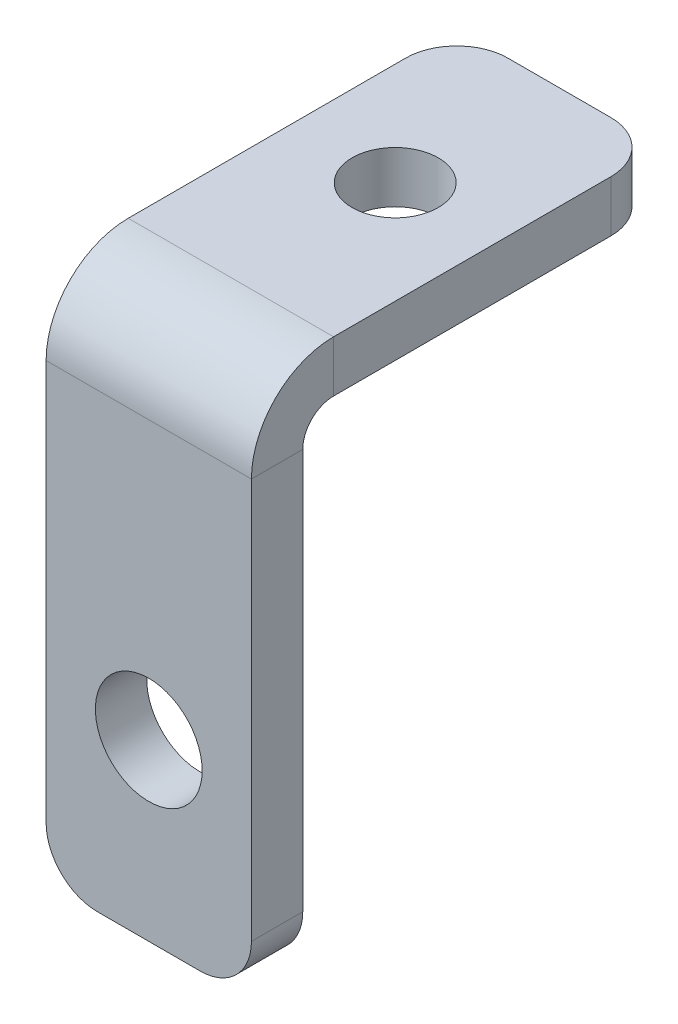
ISO-10303-21;
HEADER;
FILE_DESCRIPTION(('STEP AP214'),'2;1');
FILE_NAME('part.step','',(''),(''),'','','');
FILE_SCHEMA(('AUTOMOTIVE_DESIGN { 1 0 10303 214 1 1 1 1 }'));
ENDSEC;
DATA;
#1=APPLICATION_CONTEXT('core data for automotive mechanical design processes');
#2=APPLICATION_PROTOCOL_DEFINITION('international standard','automotive_design',2000,#1);
#3=PRODUCT_CONTEXT('',#1,'mechanical');
#4=PRODUCT('Part','Part','',(#3));
#5=PRODUCT_RELATED_PRODUCT_CATEGORY('part','',(#4));
#6=PRODUCT_DEFINITION_FORMATION('','',#4);
#7=PRODUCT_DEFINITION_CONTEXT('part definition',#1,'design');
#8=PRODUCT_DEFINITION('design','',#6,#7);
#9=PRODUCT_DEFINITION_SHAPE('','',#8);
#10=(LENGTH_UNIT() NAMED_UNIT(*) SI_UNIT(.MILLI.,.METRE.));
#11=(NAMED_UNIT(*) PLANE_ANGLE_UNIT() SI_UNIT($,.RADIAN.));
#12=(NAMED_UNIT(*) SI_UNIT($,.STERADIAN.) SOLID_ANGLE_UNIT());
#13=UNCERTAINTY_MEASURE_WITH_UNIT(LENGTH_MEASURE(1.E-05),#10,'distance_accuracy_value','');
#14=(GEOMETRIC_REPRESENTATION_CONTEXT(3) GLOBAL_UNCERTAINTY_ASSIGNED_CONTEXT((#13)) GLOBAL_UNIT_ASSIGNED_CONTEXT((#10,
#11,#12)) REPRESENTATION_CONTEXT('',''));
#15=CARTESIAN_POINT('',(0.,0.,0.));
#16=DIRECTION('',(0.,0.,1.));
#17=DIRECTION('',(1.,0.,0.));
#18=AXIS2_PLACEMENT_3D('',#15,#16,#17);
#19=CARTESIAN_POINT('',(5.,-11.,-2.5));
#20=DIRECTION('',(1.,0.,0.));
#21=DIRECTION('',(0.,0.,-1.));
#22=AXIS2_PLACEMENT_3D('',#19,#20,#21);
#23=PLANE('',#22);
#24=DIRECTION('',(0.,1.,0.));
#25=VECTOR('',#24,1.);
#26=CARTESIAN_POINT('',(5.,-11.,0.));
#27=LINE('',#26,#25);
#28=CARTESIAN_POINT('',(5.,-8.5,0.));
#29=VERTEX_POINT('',#28);
#30=CARTESIAN_POINT('',(5.,11.,0.));
#31=VERTEX_POINT('',#30);
#32=EDGE_CURVE('E164',#29,#31,#27,.T.);
#33=ORIENTED_EDGE('',*,*,#32,.F.);
#34=DIRECTION('',(0.,0.,1.));
#35=VECTOR('',#34,1.);
#36=CARTESIAN_POINT('',(5.,-8.5,-2.5));
#37=LINE('',#36,#35);
#38=CARTESIAN_POINT('',(5.,-8.5,-2.5));
#39=VERTEX_POINT('',#38);
#40=EDGE_CURVE('E210',#29,#39,#37,.F.);
#41=ORIENTED_EDGE('',*,*,#40,.T.);
#42=DIRECTION('',(0.,1.,0.));
#43=VECTOR('',#42,1.);
#44=CARTESIAN_POINT('',(5.,-11.,-2.5));
#45=LINE('',#44,#43);
#46=CARTESIAN_POINT('',(5.,11.,-2.5));
#47=VERTEX_POINT('',#46);
#48=EDGE_CURVE('E170',#39,#47,#45,.T.);
#49=ORIENTED_EDGE('',*,*,#48,.T.);
#50=DIRECTION('',(0.,0.,1.));
#51=VECTOR('',#50,1.);
#52=CARTESIAN_POINT('',(5.,11.,-2.5));
#53=LINE('',#52,#51);
#54=EDGE_CURVE('E184',#47,#31,#53,.T.);
#55=ORIENTED_EDGE('',*,*,#54,.T.);
#56=EDGE_LOOP('',(#33,#41,#49,#55));
#57=FACE_BOUND('',#56,.T.);
#58=ADVANCED_FACE('F16',(#57),#23,.T.);
#59=CARTESIAN_POINT('',(-5.,-11.,-2.5));
#60=DIRECTION('',(0.,-1.,0.));
#61=DIRECTION('',(0.,0.,-1.));
#62=AXIS2_PLACEMENT_3D('',#59,#60,#61);
#63=PLANE('',#62);
#64=DIRECTION('',(1.,0.,0.));
#65=VECTOR('',#64,1.);
#66=CARTESIAN_POINT('',(-5.,-11.,-2.5));
#67=LINE('',#66,#65);
#68=CARTESIAN_POINT('',(-2.5,-11.,-2.5));
#69=VERTEX_POINT('',#68);
#70=CARTESIAN_POINT('',(2.5,-11.,-2.5));
#71=VERTEX_POINT('',#70);
#72=EDGE_CURVE('E180',#69,#71,#67,.T.);
#73=ORIENTED_EDGE('',*,*,#72,.T.);
#74=DIRECTION('',(0.,0.,1.));
#75=VECTOR('',#74,1.);
#76=CARTESIAN_POINT('',(2.5,-11.,-2.5));
#77=LINE('',#76,#75);
#78=CARTESIAN_POINT('',(2.5,-11.,0.));
#79=VERTEX_POINT('',#78);
#80=EDGE_CURVE('E203',#71,#79,#77,.T.);
#81=ORIENTED_EDGE('',*,*,#80,.T.);
#82=DIRECTION('',(1.,0.,0.));
#83=VECTOR('',#82,1.);
#84=CARTESIAN_POINT('',(-5.,-11.,0.));
#85=LINE('',#84,#83);
#86=CARTESIAN_POINT('',(-2.5,-11.,0.));
#87=VERTEX_POINT('',#86);
#88=EDGE_CURVE('E174',#87,#79,#85,.T.);
#89=ORIENTED_EDGE('',*,*,#88,.F.);
#90=DIRECTION('',(0.,0.,1.));
#91=VECTOR('',#90,1.);
#92=CARTESIAN_POINT('',(-2.5,-11.,-2.5));
#93=LINE('',#92,#91);
#94=EDGE_CURVE('E199',#87,#69,#93,.F.);
#95=ORIENTED_EDGE('',*,*,#94,.T.);
#96=EDGE_LOOP('',(#73,#81,#89,#95));
#97=FACE_BOUND('',#96,.T.);
#98=ADVANCED_FACE('F277',(#97),#63,.T.);
#99=CARTESIAN_POINT('',(-5.,-11.,-2.5));
#100=DIRECTION('',(-1.,0.,0.));
#101=DIRECTION('',(0.,0.,1.));
#102=AXIS2_PLACEMENT_3D('',#99,#100,#101);
#103=PLANE('',#102);
#104=DIRECTION('',(0.,-1.,0.));
#105=VECTOR('',#104,1.);
#106=CARTESIAN_POINT('',(-5.,-11.,-2.5));
#107=LINE('',#106,#105);
#108=CARTESIAN_POINT('',(-5.,11.,-2.5));
#109=VERTEX_POINT('',#108);
#110=CARTESIAN_POINT('',(-5.,-8.5,-2.5));
#111=VERTEX_POINT('',#110);
#112=EDGE_CURVE('E177',#109,#111,#107,.T.);
#113=ORIENTED_EDGE('',*,*,#112,.T.);
#114=DIRECTION('',(0.,0.,1.));
#115=VECTOR('',#114,1.);
#116=CARTESIAN_POINT('',(-5.,-8.5,-2.5));
#117=LINE('',#116,#115);
#118=CARTESIAN_POINT('',(-5.,-8.5,0.));
#119=VERTEX_POINT('',#118);
#120=EDGE_CURVE('E216',#111,#119,#117,.T.);
#121=ORIENTED_EDGE('',*,*,#120,.T.);
#122=DIRECTION('',(0.,-1.,0.));
#123=VECTOR('',#122,1.);
#124=CARTESIAN_POINT('',(-5.,-11.,0.));
#125=LINE('',#124,#123);
#126=CARTESIAN_POINT('',(-5.,11.,0.));
#127=VERTEX_POINT('',#126);
#128=EDGE_CURVE('E189',#127,#119,#125,.T.);
#129=ORIENTED_EDGE('',*,*,#128,.F.);
#130=DIRECTION('',(0.,0.,1.));
#131=VECTOR('',#130,1.);
#132=CARTESIAN_POINT('',(-5.,11.,-2.5));
#133=LINE('',#132,#131);
#134=EDGE_CURVE('E196',#109,#127,#133,.T.);
#135=ORIENTED_EDGE('',*,*,#134,.F.);
#136=EDGE_LOOP('',(#113,#121,#129,#135));
#137=FACE_BOUND('',#136,.T.);
#138=ADVANCED_FACE('F256',(#137),#103,.T.);
#139=CARTESIAN_POINT('',(0.,0.,-2.5));
#140=DIRECTION('',(0.,0.,-1.));
#141=DIRECTION('',(-1.,0.,0.));
#142=AXIS2_PLACEMENT_3D('',#139,#140,#141);
#143=PLANE('',#142);
#144=CARTESIAN_POINT('',(0.,-2.49999999999947,-2.5));
#145=DIRECTION('',(0.,0.,1.));
#146=DIRECTION('',(1.,0.,0.));
#147=AXIS2_PLACEMENT_3D('',#144,#145,#146);
#148=CIRCLE('',#147,2.6);
#149=CARTESIAN_POINT('',(2.6,-2.49999999999947,-2.5));
#150=VERTEX_POINT('',#149);
#151=EDGE_CURVE('E163',#150,#150,#148,.T.);
#152=ORIENTED_EDGE('',*,*,#151,.T.);
#153=EDGE_LOOP('',(#152));
#154=FACE_BOUND('',#153,.T.);
#155=ORIENTED_EDGE('',*,*,#48,.F.);
#156=CARTESIAN_POINT('',(2.5,-8.5,-2.5));
#157=DIRECTION('',(0.,0.,-1.));
#158=DIRECTION('',(-1.,0.,0.));
#159=AXIS2_PLACEMENT_3D('',#156,#157,#158);
#160=CIRCLE('',#159,2.5);
#161=EDGE_CURVE('E214',#39,#71,#160,.T.);
#162=ORIENTED_EDGE('',*,*,#161,.T.);
#163=ORIENTED_EDGE('',*,*,#72,.F.);
#164=CARTESIAN_POINT('',(-2.5,-8.5,-2.5));
#165=DIRECTION('',(0.,0.,-1.));
#166=DIRECTION('',(-1.,0.,0.));
#167=AXIS2_PLACEMENT_3D('',#164,#165,#166);
#168=CIRCLE('',#167,2.5);
#169=EDGE_CURVE('E212',#69,#111,#168,.T.);
#170=ORIENTED_EDGE('',*,*,#169,.T.);
#171=ORIENTED_EDGE('',*,*,#112,.F.);
#172=DIRECTION('',(-1.,0.,0.));
#173=VECTOR('',#172,1.);
#174=CARTESIAN_POINT('',(-5.,11.,-2.5));
#175=LINE('',#174,#173);
#176=EDGE_CURVE('E173',#47,#109,#175,.T.);
#177=ORIENTED_EDGE('',*,*,#176,.F.);
#178=EDGE_LOOP('',(#155,#162,#163,#170,#171,#177));
#179=FACE_BOUND('',#178,.T.);
#180=ADVANCED_FACE('F260',(#154,#179),#143,.T.);
#181=CARTESIAN_POINT('',(0.,0.,0.));
#182=DIRECTION('',(0.,0.,-1.));
#183=DIRECTION('',(-1.,0.,0.));
#184=AXIS2_PLACEMENT_3D('',#181,#182,#183);
#185=PLANE('',#184);
#186=CARTESIAN_POINT('',(0.,-2.49999999999947,0.));
#187=DIRECTION('',(0.,0.,1.));
#188=DIRECTION('',(1.,0.,0.));
#189=AXIS2_PLACEMENT_3D('',#186,#187,#188);
#190=CIRCLE('',#189,2.6);
#191=CARTESIAN_POINT('',(2.6,-2.49999999999947,0.));
#192=VERTEX_POINT('',#191);
#193=EDGE_CURVE('E339',#192,#192,#190,.T.);
#194=ORIENTED_EDGE('',*,*,#193,.F.);
#195=EDGE_LOOP('',(#194));
#196=FACE_BOUND('',#195,.T.);
#197=ORIENTED_EDGE('',*,*,#88,.T.);
#198=CARTESIAN_POINT('',(2.5,-8.5,0.));
#199=DIRECTION('',(0.,0.,-1.));
#200=DIRECTION('',(-1.,0.,0.));
#201=AXIS2_PLACEMENT_3D('',#198,#199,#200);
#202=CIRCLE('',#201,2.5);
#203=EDGE_CURVE('E208',#79,#29,#202,.F.);
#204=ORIENTED_EDGE('',*,*,#203,.T.);
#205=ORIENTED_EDGE('',*,*,#32,.T.);
#206=DIRECTION('',(-1.,0.,0.));
#207=VECTOR('',#206,1.);
#208=CARTESIAN_POINT('',(-5.,11.,0.));
#209=LINE('',#208,#207);
#210=EDGE_CURVE('E116',#31,#127,#209,.T.);
#211=ORIENTED_EDGE('',*,*,#210,.T.);
#212=ORIENTED_EDGE('',*,*,#128,.T.);
#213=CARTESIAN_POINT('',(-2.5,-8.5,0.));
#214=DIRECTION('',(0.,0.,-1.));
#215=DIRECTION('',(-1.,0.,0.));
#216=AXIS2_PLACEMENT_3D('',#213,#214,#215);
#217=CIRCLE('',#216,2.5);
#218=EDGE_CURVE('E206',#119,#87,#217,.F.);
#219=ORIENTED_EDGE('',*,*,#218,.T.);
#220=EDGE_LOOP('',(#197,#204,#205,#211,#212,#219));
#221=FACE_BOUND('',#220,.T.);
#222=ADVANCED_FACE('F267',(#196,#221),#185,.F.);
#223=CARTESIAN_POINT('',(-5.,11.,-4.));
#224=DIRECTION('',(-1.,0.,0.));
#225=DIRECTION('',(0.,0.,1.));
#226=AXIS2_PLACEMENT_3D('',#223,#224,#225);
#227=PLANE('',#226);
#228=DIRECTION('',(0.,-1.,0.));
#229=VECTOR('',#228,1.);
#230=CARTESIAN_POINT('',(-5.,15.,-3.99999999999998));
#231=LINE('',#230,#229);
#232=CARTESIAN_POINT('',(-5.,12.5,-3.99999999999999));
#233=VERTEX_POINT('',#232);
#234=CARTESIAN_POINT('',(-5.,15.,-3.99999999999998));
#235=VERTEX_POINT('',#234);
#236=EDGE_CURVE('E159',#233,#235,#231,.F.);
#237=ORIENTED_EDGE('',*,*,#236,.F.);
#238=CARTESIAN_POINT('',(-5.,11.,-4.));
#239=DIRECTION('',(1.,0.,0.));
#240=DIRECTION('',(0.,0.,-1.));
#241=AXIS2_PLACEMENT_3D('',#238,#239,#240);
#242=CIRCLE('',#241,1.5);
#243=EDGE_CURVE('E121',#109,#233,#242,.F.);
#244=ORIENTED_EDGE('',*,*,#243,.F.);
#245=ORIENTED_EDGE('',*,*,#134,.T.);
#246=CARTESIAN_POINT('',(-5.,11.,-4.));
#247=DIRECTION('',(1.,0.,0.));
#248=DIRECTION('',(0.,0.,-1.));
#249=AXIS2_PLACEMENT_3D('',#246,#247,#248);
#250=CIRCLE('',#249,4.);
#251=EDGE_CURVE('E120',#127,#235,#250,.F.);
#252=ORIENTED_EDGE('',*,*,#251,.T.);
#253=EDGE_LOOP('',(#237,#244,#245,#252));
#254=FACE_BOUND('',#253,.T.);
#255=ADVANCED_FACE('F252',(#254),#227,.T.);
#256=CARTESIAN_POINT('',(5.,11.,-4.));
#257=DIRECTION('',(-1.,0.,0.));
#258=DIRECTION('',(0.,0.,1.));
#259=AXIS2_PLACEMENT_3D('',#256,#257,#258);
#260=PLANE('',#259);
#261=CARTESIAN_POINT('',(5.,11.,-4.));
#262=DIRECTION('',(1.,0.,0.));
#263=DIRECTION('',(0.,0.,-1.));
#264=AXIS2_PLACEMENT_3D('',#261,#262,#263);
#265=CIRCLE('',#264,1.5);
#266=CARTESIAN_POINT('',(5.,12.5,-3.99999999999999));
#267=VERTEX_POINT('',#266);
#268=EDGE_CURVE('E128',#267,#47,#265,.T.);
#269=ORIENTED_EDGE('',*,*,#268,.F.);
#270=DIRECTION('',(0.,-1.,0.));
#271=VECTOR('',#270,1.);
#272=CARTESIAN_POINT('',(5.,12.5,-3.99999999999999));
#273=LINE('',#272,#271);
#274=CARTESIAN_POINT('',(5.,15.,-3.99999999999998));
#275=VERTEX_POINT('',#274);
#276=EDGE_CURVE('E125',#267,#275,#273,.F.);
#277=ORIENTED_EDGE('',*,*,#276,.T.);
#278=CARTESIAN_POINT('',(5.,11.,-4.));
#279=DIRECTION('',(1.,0.,0.));
#280=DIRECTION('',(0.,0.,-1.));
#281=AXIS2_PLACEMENT_3D('',#278,#279,#280);
#282=CIRCLE('',#281,4.);
#283=EDGE_CURVE('E109',#275,#31,#282,.T.);
#284=ORIENTED_EDGE('',*,*,#283,.T.);
#285=ORIENTED_EDGE('',*,*,#54,.F.);
#286=EDGE_LOOP('',(#269,#277,#284,#285));
#287=FACE_BOUND('',#286,.T.);
#288=ADVANCED_FACE('F126',(#287),#260,.F.);
#289=CARTESIAN_POINT('',(5.,11.,-4.));
#290=DIRECTION('',(1.,0.,0.));
#291=DIRECTION('',(0.,1.,0.));
#292=AXIS2_PLACEMENT_3D('',#289,#290,#291);
#293=CYLINDRICAL_SURFACE('',#292,4.);
#294=ORIENTED_EDGE('',*,*,#210,.F.);
#295=ORIENTED_EDGE('',*,*,#283,.F.);
#296=DIRECTION('',(1.,0.,0.));
#297=VECTOR('',#296,1.);
#298=CARTESIAN_POINT('',(-5.,15.,-3.99999999999998));
#299=LINE('',#298,#297);
#300=EDGE_CURVE('E113',#275,#235,#299,.F.);
#301=ORIENTED_EDGE('',*,*,#300,.T.);
#302=ORIENTED_EDGE('',*,*,#251,.F.);
#303=EDGE_LOOP('',(#294,#295,#301,#302));
#304=FACE_BOUND('',#303,.T.);
#305=ADVANCED_FACE('F111',(#304),#293,.T.);
#306=CARTESIAN_POINT('',(5.,11.,-4.));
#307=DIRECTION('',(1.,0.,0.));
#308=DIRECTION('',(0.,1.,0.));
#309=AXIS2_PLACEMENT_3D('',#306,#307,#308);
#310=CYLINDRICAL_SURFACE('',#309,1.5);
#311=ORIENTED_EDGE('',*,*,#176,.T.);
#312=ORIENTED_EDGE('',*,*,#243,.T.);
#313=DIRECTION('',(1.,0.,0.));
#314=VECTOR('',#313,1.);
#315=CARTESIAN_POINT('',(-5.,12.5,-3.99999999999999));
#316=LINE('',#315,#314);
#317=EDGE_CURVE('E130',#233,#267,#316,.T.);
#318=ORIENTED_EDGE('',*,*,#317,.T.);
#319=ORIENTED_EDGE('',*,*,#268,.T.);
#320=EDGE_LOOP('',(#311,#312,#318,#319));
#321=FACE_BOUND('',#320,.T.);
#322=ADVANCED_FACE('F247',(#321),#310,.F.);
#323=CARTESIAN_POINT('',(5.,15.0000000000001,-20.));
#324=DIRECTION('',(-1.,0.,0.));
#325=DIRECTION('',(0.,0.,1.));
#326=AXIS2_PLACEMENT_3D('',#323,#324,#325);
#327=PLANE('',#326);
#328=DIRECTION('',(0.,0.,1.));
#329=VECTOR('',#328,1.);
#330=CARTESIAN_POINT('',(5.,12.5000000000001,-20.));
#331=LINE('',#330,#329);
#332=CARTESIAN_POINT('',(5.,12.5,-17.5));
#333=VERTEX_POINT('',#332);
#334=EDGE_CURVE('E137',#267,#333,#331,.F.);
#335=ORIENTED_EDGE('',*,*,#334,.T.);
#336=DIRECTION('',(0.,-1.,0.));
#337=VECTOR('',#336,1.);
#338=CARTESIAN_POINT('',(5.,15.,-17.5));
#339=LINE('',#338,#337);
#340=CARTESIAN_POINT('',(5.,15.,-17.5));
#341=VERTEX_POINT('',#340);
#342=EDGE_CURVE('E39',#333,#341,#339,.F.);
#343=ORIENTED_EDGE('',*,*,#342,.T.);
#344=DIRECTION('',(0.,0.,-1.));
#345=VECTOR('',#344,1.);
#346=CARTESIAN_POINT('',(5.,15.,0.));
#347=LINE('',#346,#345);
#348=EDGE_CURVE('E133',#275,#341,#347,.T.);
#349=ORIENTED_EDGE('',*,*,#348,.F.);
#350=ORIENTED_EDGE('',*,*,#276,.F.);
#351=EDGE_LOOP('',(#335,#343,#349,#350));
#352=FACE_BOUND('',#351,.T.);
#353=ADVANCED_FACE('F139',(#352),#327,.F.);
#354=CARTESIAN_POINT('',(-5.,15.,-2.49999999999999));
#355=DIRECTION('',(1.,0.,0.));
#356=DIRECTION('',(0.,0.,-1.));
#357=AXIS2_PLACEMENT_3D('',#354,#355,#356);
#358=PLANE('',#357);
#359=DIRECTION('',(0.,0.,1.));
#360=VECTOR('',#359,1.);
#361=CARTESIAN_POINT('',(-5.,15.,0.));
#362=LINE('',#361,#360);
#363=CARTESIAN_POINT('',(-5.,15.,-17.5));
#364=VERTEX_POINT('',#363);
#365=EDGE_CURVE('E135',#364,#235,#362,.T.);
#366=ORIENTED_EDGE('',*,*,#365,.F.);
#367=DIRECTION('',(0.,-1.,0.));
#368=VECTOR('',#367,1.);
#369=CARTESIAN_POINT('',(-5.,15.,-17.5));
#370=LINE('',#369,#368);
#371=CARTESIAN_POINT('',(-5.,12.5,-17.5));
#372=VERTEX_POINT('',#371);
#373=EDGE_CURVE('E10',#364,#372,#370,.T.);
#374=ORIENTED_EDGE('',*,*,#373,.T.);
#375=DIRECTION('',(0.,0.,-1.));
#376=VECTOR('',#375,1.);
#377=CARTESIAN_POINT('',(-5.,12.5,-2.5));
#378=LINE('',#377,#376);
#379=EDGE_CURVE('E142',#372,#233,#378,.F.);
#380=ORIENTED_EDGE('',*,*,#379,.T.);
#381=ORIENTED_EDGE('',*,*,#236,.T.);
#382=EDGE_LOOP('',(#366,#374,#380,#381));
#383=FACE_BOUND('',#382,.T.);
#384=ADVANCED_FACE('F244',(#383),#358,.F.);
#385=CARTESIAN_POINT('',(0.,15.,0.));
#386=DIRECTION('',(0.,-1.,0.));
#387=DIRECTION('',(0.,0.,-1.));
#388=AXIS2_PLACEMENT_3D('',#385,#386,#387);
#389=PLANE('',#388);
#390=CARTESIAN_POINT('',(0.,15.,-12.));
#391=DIRECTION('',(0.,1.,0.));
#392=DIRECTION('',(0.,0.,1.));
#393=AXIS2_PLACEMENT_3D('',#390,#391,#392);
#394=CIRCLE('',#393,2.1);
#395=CARTESIAN_POINT('',(0.,15.,-9.89999999999999));
#396=VERTEX_POINT('',#395);
#397=EDGE_CURVE('E347',#396,#396,#394,.T.);
#398=ORIENTED_EDGE('',*,*,#397,.F.);
#399=EDGE_LOOP('',(#398));
#400=FACE_BOUND('',#399,.T.);
#401=ORIENTED_EDGE('',*,*,#348,.T.);
#402=CARTESIAN_POINT('',(2.5,15.,-17.5));
#403=DIRECTION('',(0.,-1.,0.));
#404=DIRECTION('',(0.,0.,-1.));
#405=AXIS2_PLACEMENT_3D('',#402,#403,#404);
#406=CIRCLE('',#405,2.5);
#407=CARTESIAN_POINT('',(2.5,15.0000000000001,-20.));
#408=VERTEX_POINT('',#407);
#409=EDGE_CURVE('E24',#341,#408,#406,.F.);
#410=ORIENTED_EDGE('',*,*,#409,.T.);
#411=DIRECTION('',(-1.,0.,0.));
#412=VECTOR('',#411,1.);
#413=CARTESIAN_POINT('',(0.,15.0000000000001,-20.));
#414=LINE('',#413,#412);
#415=CARTESIAN_POINT('',(-2.5,15.0000000000001,-20.));
#416=VERTEX_POINT('',#415);
#417=EDGE_CURVE('E141',#408,#416,#414,.T.);
#418=ORIENTED_EDGE('',*,*,#417,.T.);
#419=CARTESIAN_POINT('',(-2.5,15.,-17.5));
#420=DIRECTION('',(0.,-1.,0.));
#421=DIRECTION('',(0.,0.,-1.));
#422=AXIS2_PLACEMENT_3D('',#419,#420,#421);
#423=CIRCLE('',#422,2.5);
#424=EDGE_CURVE('E31',#416,#364,#423,.F.);
#425=ORIENTED_EDGE('',*,*,#424,.T.);
#426=ORIENTED_EDGE('',*,*,#365,.T.);
#427=ORIENTED_EDGE('',*,*,#300,.F.);
#428=EDGE_LOOP('',(#401,#410,#418,#425,#426,#427));
#429=FACE_BOUND('',#428,.T.);
#430=ADVANCED_FACE('F132',(#400,#429),#389,.F.);
#431=CARTESIAN_POINT('',(0.,12.5,0.));
#432=DIRECTION('',(0.,-1.,0.));
#433=DIRECTION('',(0.,0.,-1.));
#434=AXIS2_PLACEMENT_3D('',#431,#432,#433);
#435=PLANE('',#434);
#436=CARTESIAN_POINT('',(0.,12.5,-12.));
#437=DIRECTION('',(0.,1.,0.));
#438=DIRECTION('',(0.,0.,1.));
#439=AXIS2_PLACEMENT_3D('',#436,#437,#438);
#440=CIRCLE('',#439,2.1);
#441=CARTESIAN_POINT('',(0.,12.5,-9.9));
#442=VERTEX_POINT('',#441);
#443=EDGE_CURVE('E344',#442,#442,#440,.T.);
#444=ORIENTED_EDGE('',*,*,#443,.T.);
#445=EDGE_LOOP('',(#444));
#446=FACE_BOUND('',#445,.T.);
#447=DIRECTION('',(1.,0.,0.));
#448=VECTOR('',#447,1.);
#449=CARTESIAN_POINT('',(-5.,12.5000000000001,-20.));
#450=LINE('',#449,#448);
#451=CARTESIAN_POINT('',(2.5,12.5000000000001,-20.));
#452=VERTEX_POINT('',#451);
#453=CARTESIAN_POINT('',(-2.5,12.5000000000001,-20.));
#454=VERTEX_POINT('',#453);
#455=EDGE_CURVE('E150',#452,#454,#450,.F.);
#456=ORIENTED_EDGE('',*,*,#455,.F.);
#457=CARTESIAN_POINT('',(2.5,12.5,-17.5));
#458=DIRECTION('',(0.,-1.,0.));
#459=DIRECTION('',(0.,0.,-1.));
#460=AXIS2_PLACEMENT_3D('',#457,#458,#459);
#461=CIRCLE('',#460,2.5);
#462=EDGE_CURVE('E226',#452,#333,#461,.T.);
#463=ORIENTED_EDGE('',*,*,#462,.T.);
#464=ORIENTED_EDGE('',*,*,#334,.F.);
#465=ORIENTED_EDGE('',*,*,#317,.F.);
#466=ORIENTED_EDGE('',*,*,#379,.F.);
#467=CARTESIAN_POINT('',(-2.5,12.5,-17.5));
#468=DIRECTION('',(0.,-1.,0.));
#469=DIRECTION('',(0.,0.,-1.));
#470=AXIS2_PLACEMENT_3D('',#467,#468,#469);
#471=CIRCLE('',#470,2.5);
#472=EDGE_CURVE('E224',#372,#454,#471,.T.);
#473=ORIENTED_EDGE('',*,*,#472,.T.);
#474=EDGE_LOOP('',(#456,#463,#464,#465,#466,#473));
#475=FACE_BOUND('',#474,.T.);
#476=ADVANCED_FACE('F238',(#446,#475),#435,.T.);
#477=CARTESIAN_POINT('',(-5.,15.0000000000001,-20.));
#478=DIRECTION('',(0.,0.,1.));
#479=DIRECTION('',(0.,-1.,0.));
#480=AXIS2_PLACEMENT_3D('',#477,#478,#479);
#481=PLANE('',#480);
#482=ORIENTED_EDGE('',*,*,#417,.F.);
#483=DIRECTION('',(0.,-1.,0.));
#484=VECTOR('',#483,1.);
#485=CARTESIAN_POINT('',(2.5,15.0000000000001,-20.));
#486=LINE('',#485,#484);
#487=EDGE_CURVE('E221',#408,#452,#486,.T.);
#488=ORIENTED_EDGE('',*,*,#487,.T.);
#489=ORIENTED_EDGE('',*,*,#455,.T.);
#490=DIRECTION('',(0.,-1.,0.));
#491=VECTOR('',#490,1.);
#492=CARTESIAN_POINT('',(-2.5,15.0000000000001,-20.));
#493=LINE('',#492,#491);
#494=EDGE_CURVE('E219',#454,#416,#493,.F.);
#495=ORIENTED_EDGE('',*,*,#494,.T.);
#496=EDGE_LOOP('',(#482,#488,#489,#495));
#497=FACE_BOUND('',#496,.T.);
#498=ADVANCED_FACE('F233',(#497),#481,.F.);
#499=CARTESIAN_POINT('',(2.5,-8.5,-2.5));
#500=DIRECTION('',(0.,0.,1.));
#501=DIRECTION('',(1.,0.,0.));
#502=AXIS2_PLACEMENT_3D('',#499,#500,#501);
#503=CYLINDRICAL_SURFACE('',#502,2.5);
#504=ORIENTED_EDGE('',*,*,#161,.F.);
#505=ORIENTED_EDGE('',*,*,#40,.F.);
#506=ORIENTED_EDGE('',*,*,#203,.F.);
#507=ORIENTED_EDGE('',*,*,#80,.F.);
#508=EDGE_LOOP('',(#504,#505,#506,#507));
#509=FACE_BOUND('',#508,.T.);
#510=ADVANCED_FACE('F274',(#509),#503,.T.);
#511=CARTESIAN_POINT('',(-2.5,-8.5,-2.5));
#512=DIRECTION('',(0.,0.,1.));
#513=DIRECTION('',(1.,0.,0.));
#514=AXIS2_PLACEMENT_3D('',#511,#512,#513);
#515=CYLINDRICAL_SURFACE('',#514,2.5);
#516=ORIENTED_EDGE('',*,*,#169,.F.);
#517=ORIENTED_EDGE('',*,*,#94,.F.);
#518=ORIENTED_EDGE('',*,*,#218,.F.);
#519=ORIENTED_EDGE('',*,*,#120,.F.);
#520=EDGE_LOOP('',(#516,#517,#518,#519));
#521=FACE_BOUND('',#520,.T.);
#522=ADVANCED_FACE('F265',(#521),#515,.T.);
#523=CARTESIAN_POINT('',(2.5,15.,-17.5));
#524=DIRECTION('',(0.,-1.,0.));
#525=DIRECTION('',(0.,0.,-1.));
#526=AXIS2_PLACEMENT_3D('',#523,#524,#525);
#527=CYLINDRICAL_SURFACE('',#526,2.5);
#528=ORIENTED_EDGE('',*,*,#409,.F.);
#529=ORIENTED_EDGE('',*,*,#342,.F.);
#530=ORIENTED_EDGE('',*,*,#462,.F.);
#531=ORIENTED_EDGE('',*,*,#487,.F.);
#532=EDGE_LOOP('',(#528,#529,#530,#531));
#533=FACE_BOUND('',#532,.T.);
#534=ADVANCED_FACE('F236',(#533),#527,.T.);
#535=CARTESIAN_POINT('',(-2.5,15.,-17.5));
#536=DIRECTION('',(0.,-1.,0.));
#537=DIRECTION('',(0.,0.,-1.));
#538=AXIS2_PLACEMENT_3D('',#535,#536,#537);
#539=CYLINDRICAL_SURFACE('',#538,2.5);
#540=ORIENTED_EDGE('',*,*,#424,.F.);
#541=ORIENTED_EDGE('',*,*,#494,.F.);
#542=ORIENTED_EDGE('',*,*,#472,.F.);
#543=ORIENTED_EDGE('',*,*,#373,.F.);
#544=EDGE_LOOP('',(#540,#541,#542,#543));
#545=FACE_BOUND('',#544,.T.);
#546=ADVANCED_FACE('F18',(#545),#539,.T.);
#547=CARTESIAN_POINT('',(0.,-2.49999999999947,-2.5));
#548=DIRECTION('',(0.,0.,1.));
#549=DIRECTION('',(1.,0.,0.));
#550=AXIS2_PLACEMENT_3D('',#547,#548,#549);
#551=CYLINDRICAL_SURFACE('',#550,2.6);
#552=ORIENTED_EDGE('',*,*,#151,.F.);
#553=EDGE_LOOP('',(#552));
#554=FACE_BOUND('',#553,.T.);
#555=ORIENTED_EDGE('',*,*,#193,.T.);
#556=EDGE_LOOP('',(#555));
#557=FACE_BOUND('',#556,.T.);
#558=ADVANCED_FACE('F297',(#554,#557),#551,.F.);
#559=CARTESIAN_POINT('',(0.,12.5,-12.));
#560=DIRECTION('',(0.,1.,0.));
#561=DIRECTION('',(0.,0.,1.));
#562=AXIS2_PLACEMENT_3D('',#559,#560,#561);
#563=CYLINDRICAL_SURFACE('',#562,2.1);
#564=ORIENTED_EDGE('',*,*,#443,.F.);
#565=EDGE_LOOP('',(#564));
#566=FACE_BOUND('',#565,.T.);
#567=ORIENTED_EDGE('',*,*,#397,.T.);
#568=EDGE_LOOP('',(#567));
#569=FACE_BOUND('',#568,.T.);
#570=ADVANCED_FACE('F301',(#566,#569),#563,.F.);
#571=CLOSED_SHELL('',(#58,#98,#138,#180,#222,#255,#288,#305,#322,#353,#384,#430,#476,#498,#510,
#522,#534,#546,#558,#570));
#572=MANIFOLD_SOLID_BREP('B1',#571);
#573=ADVANCED_BREP_SHAPE_REPRESENTATION('',(#18,#572),#14);
#574=SHAPE_DEFINITION_REPRESENTATION(#9,#573);
ENDSEC;
END-ISO-10303-21;
